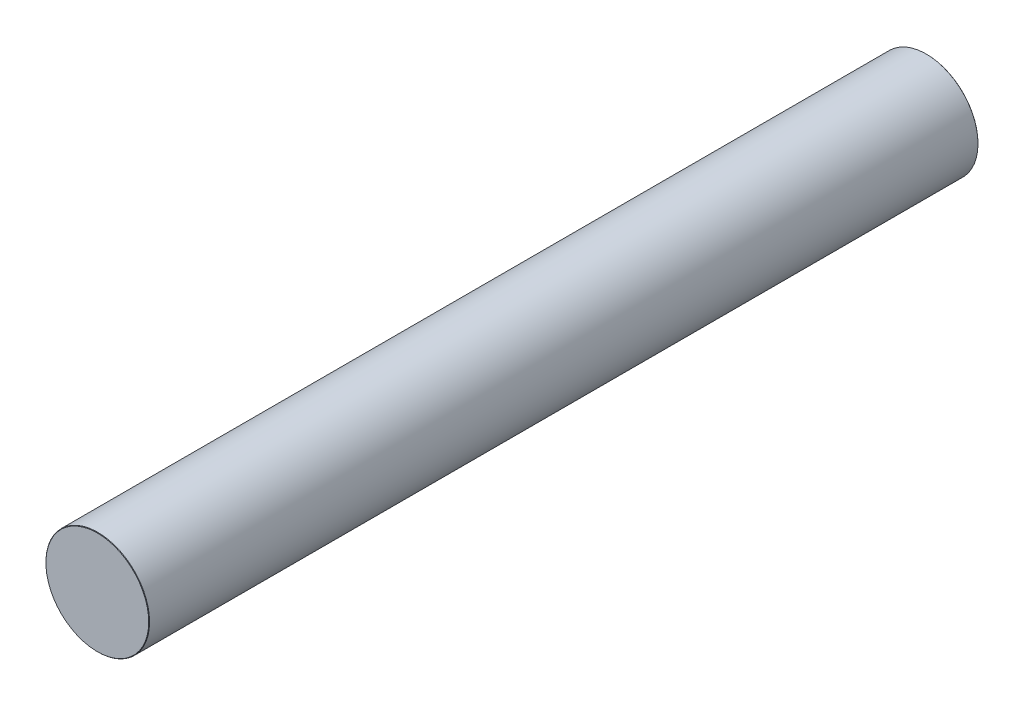
ISO-10303-21;
HEADER;
FILE_DESCRIPTION(('STEP AP214'),'2;1');
FILE_NAME('part.step','',(''),(''),'','','');
FILE_SCHEMA(('AUTOMOTIVE_DESIGN { 1 0 10303 214 1 1 1 1 }'));
ENDSEC;
DATA;
#1=APPLICATION_CONTEXT('core data for automotive mechanical design processes');
#2=APPLICATION_PROTOCOL_DEFINITION('international standard','automotive_design',2000,#1);
#3=PRODUCT_CONTEXT('',#1,'mechanical');
#4=PRODUCT('Part','Part','',(#3));
#5=PRODUCT_RELATED_PRODUCT_CATEGORY('part','',(#4));
#6=PRODUCT_DEFINITION_FORMATION('','',#4);
#7=PRODUCT_DEFINITION_CONTEXT('part definition',#1,'design');
#8=PRODUCT_DEFINITION('design','',#6,#7);
#9=PRODUCT_DEFINITION_SHAPE('','',#8);
#10=(LENGTH_UNIT() NAMED_UNIT(*) SI_UNIT(.MILLI.,.METRE.));
#11=(NAMED_UNIT(*) PLANE_ANGLE_UNIT() SI_UNIT($,.RADIAN.));
#12=(NAMED_UNIT(*) SI_UNIT($,.STERADIAN.) SOLID_ANGLE_UNIT());
#13=UNCERTAINTY_MEASURE_WITH_UNIT(LENGTH_MEASURE(1.E-05),#10,'distance_accuracy_value','');
#14=(GEOMETRIC_REPRESENTATION_CONTEXT(3) GLOBAL_UNCERTAINTY_ASSIGNED_CONTEXT((#13)) GLOBAL_UNIT_ASSIGNED_CONTEXT((#10,
#11,#12)) REPRESENTATION_CONTEXT('',''));
#15=CARTESIAN_POINT('',(0.,0.,0.));
#16=DIRECTION('',(0.,0.,1.));
#17=DIRECTION('',(1.,0.,0.));
#18=AXIS2_PLACEMENT_3D('',#15,#16,#17);
#19=CARTESIAN_POINT('',(0.,0.,200.));
#20=DIRECTION('',(0.,0.,-1.));
#21=DIRECTION('',(-1.,0.,0.));
#22=AXIS2_PLACEMENT_3D('',#19,#20,#21);
#23=CYLINDRICAL_SURFACE('',#22,12.5);
#24=CARTESIAN_POINT('',(0.,0.,0.100000000000017));
#25=DIRECTION('',(0.,0.,1.));
#26=DIRECTION('',(1.,0.,0.));
#27=AXIS2_PLACEMENT_3D('',#24,#25,#26);
#28=CIRCLE('',#27,12.5);
#29=CARTESIAN_POINT('',(12.5,0.,0.100000000000017));
#30=VERTEX_POINT('',#29);
#31=EDGE_CURVE('E45',#30,#30,#28,.T.);
#32=ORIENTED_EDGE('',*,*,#31,.T.);
#33=EDGE_LOOP('',(#32));
#34=FACE_BOUND('',#33,.T.);
#35=CARTESIAN_POINT('',(0.,0.,199.9));
#36=DIRECTION('',(0.,0.,1.));
#37=DIRECTION('',(1.,0.,0.));
#38=AXIS2_PLACEMENT_3D('',#35,#36,#37);
#39=CIRCLE('',#38,12.5);
#40=CARTESIAN_POINT('',(12.5,0.,199.9));
#41=VERTEX_POINT('',#40);
#42=EDGE_CURVE('E49',#41,#41,#39,.F.);
#43=ORIENTED_EDGE('',*,*,#42,.T.);
#44=EDGE_LOOP('',(#43));
#45=FACE_BOUND('',#44,.T.);
#46=ADVANCED_FACE('F34',(#34,#45),#23,.T.);
#47=CARTESIAN_POINT('',(0.,0.,200.));
#48=DIRECTION('',(0.,0.,1.));
#49=DIRECTION('',(1.,0.,0.));
#50=AXIS2_PLACEMENT_3D('',#47,#48,#49);
#51=PLANE('',#50);
#52=CARTESIAN_POINT('',(0.,0.,200.));
#53=DIRECTION('',(0.,0.,1.));
#54=DIRECTION('',(1.,0.,0.));
#55=AXIS2_PLACEMENT_3D('',#52,#53,#54);
#56=CIRCLE('',#55,12.4);
#57=CARTESIAN_POINT('',(12.4,0.,200.));
#58=VERTEX_POINT('',#57);
#59=EDGE_CURVE('E10',#58,#58,#56,.T.);
#60=ORIENTED_EDGE('',*,*,#59,.T.);
#61=EDGE_LOOP('',(#60));
#62=FACE_BOUND('',#61,.T.);
#63=ADVANCED_FACE('F65',(#62),#51,.T.);
#64=CARTESIAN_POINT('',(0.,0.,0.));
#65=DIRECTION('',(0.,0.,1.));
#66=DIRECTION('',(1.,0.,0.));
#67=AXIS2_PLACEMENT_3D('',#64,#65,#66);
#68=PLANE('',#67);
#69=CARTESIAN_POINT('',(0.,0.,0.));
#70=DIRECTION('',(0.,0.,1.));
#71=DIRECTION('',(1.,0.,0.));
#72=AXIS2_PLACEMENT_3D('',#69,#70,#71);
#73=CIRCLE('',#72,12.4);
#74=CARTESIAN_POINT('',(12.4,0.,0.));
#75=VERTEX_POINT('',#74);
#76=EDGE_CURVE('E41',#75,#75,#73,.F.);
#77=ORIENTED_EDGE('',*,*,#76,.T.);
#78=EDGE_LOOP('',(#77));
#79=FACE_BOUND('',#78,.T.);
#80=ADVANCED_FACE('F62',(#79),#68,.F.);
#81=CARTESIAN_POINT('',(0.,0.,0.100000000000017));
#82=DIRECTION('',(0.,0.,1.));
#83=DIRECTION('',(1.,0.,0.));
#84=AXIS2_PLACEMENT_3D('',#81,#82,#83);
#85=CONICAL_SURFACE('',#84,12.5,0.785398163397396);
#86=ORIENTED_EDGE('',*,*,#76,.F.);
#87=EDGE_LOOP('',(#86));
#88=FACE_BOUND('',#87,.T.);
#89=ORIENTED_EDGE('',*,*,#31,.F.);
#90=EDGE_LOOP('',(#89));
#91=FACE_BOUND('',#90,.T.);
#92=ADVANCED_FACE('F58',(#88,#91),#85,.T.);
#93=CARTESIAN_POINT('',(0.,0.,200.));
#94=DIRECTION('',(0.,0.,-1.));
#95=DIRECTION('',(-1.,0.,0.));
#96=AXIS2_PLACEMENT_3D('',#93,#94,#95);
#97=CONICAL_SURFACE('',#96,12.4,0.785398163397535);
#98=ORIENTED_EDGE('',*,*,#42,.F.);
#99=EDGE_LOOP('',(#98));
#100=FACE_BOUND('',#99,.T.);
#101=ORIENTED_EDGE('',*,*,#59,.F.);
#102=EDGE_LOOP('',(#101));
#103=FACE_BOUND('',#102,.T.);
#104=ADVANCED_FACE('F36',(#100,#103),#97,.T.);
#105=CLOSED_SHELL('',(#46,#63,#80,#92,#104));
#106=MANIFOLD_SOLID_BREP('B2',#105);
#107=ADVANCED_BREP_SHAPE_REPRESENTATION('',(#18,#106),#14);
#108=SHAPE_DEFINITION_REPRESENTATION(#9,#107);
ENDSEC;
END-ISO-10303-21;
